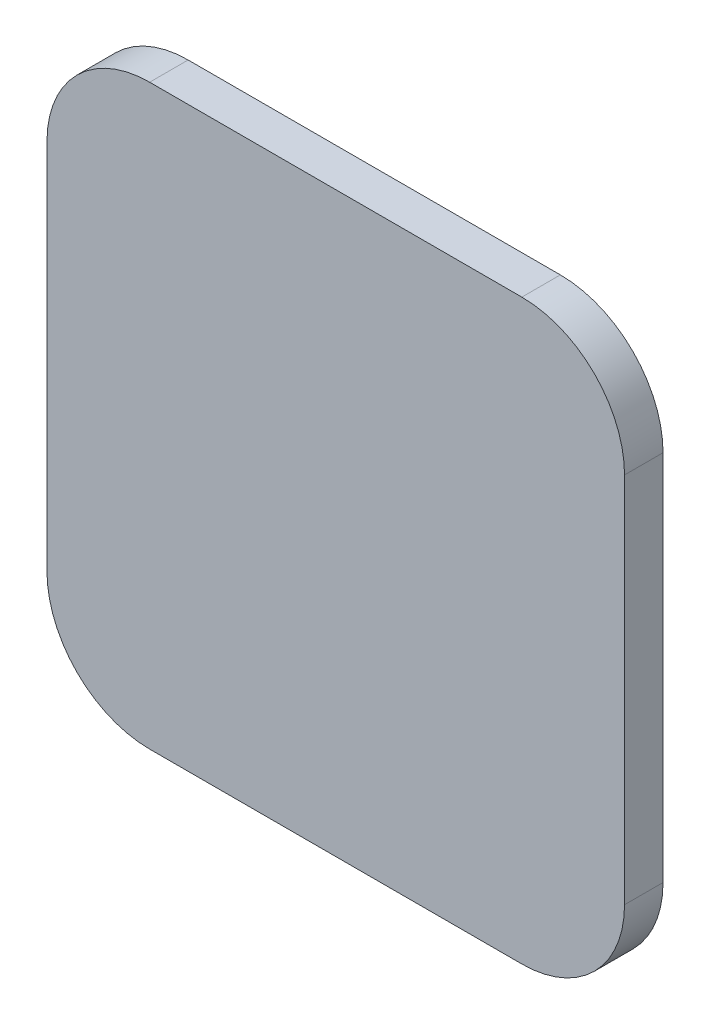
ISO-10303-21;
HEADER;
FILE_DESCRIPTION(('STEP AP214'),'2;1');
FILE_NAME('part.step','',(''),(''),'','','');
FILE_SCHEMA(('AUTOMOTIVE_DESIGN { 1 0 10303 214 1 1 1 1 }'));
ENDSEC;
DATA;
#1=APPLICATION_CONTEXT('core data for automotive mechanical design processes');
#2=APPLICATION_PROTOCOL_DEFINITION('international standard','automotive_design',2000,#1);
#3=PRODUCT_CONTEXT('',#1,'mechanical');
#4=PRODUCT('Part','Part','',(#3));
#5=PRODUCT_RELATED_PRODUCT_CATEGORY('part','',(#4));
#6=PRODUCT_DEFINITION_FORMATION('','',#4);
#7=PRODUCT_DEFINITION_CONTEXT('part definition',#1,'design');
#8=PRODUCT_DEFINITION('design','',#6,#7);
#9=PRODUCT_DEFINITION_SHAPE('','',#8);
#10=(LENGTH_UNIT() NAMED_UNIT(*) SI_UNIT(.MILLI.,.METRE.));
#11=(NAMED_UNIT(*) PLANE_ANGLE_UNIT() SI_UNIT($,.RADIAN.));
#12=(NAMED_UNIT(*) SI_UNIT($,.STERADIAN.) SOLID_ANGLE_UNIT());
#13=UNCERTAINTY_MEASURE_WITH_UNIT(LENGTH_MEASURE(1.E-05),#10,'distance_accuracy_value','');
#14=(GEOMETRIC_REPRESENTATION_CONTEXT(3) GLOBAL_UNCERTAINTY_ASSIGNED_CONTEXT((#13)) GLOBAL_UNIT_ASSIGNED_CONTEXT((#10,
#11,#12)) REPRESENTATION_CONTEXT('',''));
#15=CARTESIAN_POINT('',(0.,0.,0.));
#16=DIRECTION('',(0.,0.,1.));
#17=DIRECTION('',(1.,0.,0.));
#18=AXIS2_PLACEMENT_3D('',#15,#16,#17);
#19=CARTESIAN_POINT('',(1213.5748213672,143.,-3.));
#20=DIRECTION('',(0.,0.,1.));
#21=DIRECTION('',(1.,0.,0.));
#22=AXIS2_PLACEMENT_3D('',#19,#20,#21);
#23=CYLINDRICAL_SURFACE('',#22,8.00000000000001);
#24=CARTESIAN_POINT('',(1213.5748213672,143.,0.));
#25=DIRECTION('',(0.,0.,1.));
#26=DIRECTION('',(1.,0.,0.));
#27=AXIS2_PLACEMENT_3D('',#24,#25,#26);
#28=CIRCLE('',#27,8.00000000000001);
#29=CARTESIAN_POINT('',(1205.5748213672,143.,0.));
#30=VERTEX_POINT('',#29);
#31=CARTESIAN_POINT('',(1213.5748213672,135.,0.));
#32=VERTEX_POINT('',#31);
#33=EDGE_CURVE('E132',#30,#32,#28,.T.);
#34=ORIENTED_EDGE('',*,*,#33,.F.);
#35=DIRECTION('',(0.,0.,1.));
#36=VECTOR('',#35,1.);
#37=CARTESIAN_POINT('',(1205.5748213672,143.,-3.));
#38=LINE('',#37,#36);
#39=CARTESIAN_POINT('',(1205.5748213672,143.,-3.));
#40=VERTEX_POINT('',#39);
#41=EDGE_CURVE('E11',#40,#30,#38,.T.);
#42=ORIENTED_EDGE('',*,*,#41,.F.);
#43=CARTESIAN_POINT('',(1213.5748213672,143.,-3.));
#44=DIRECTION('',(0.,0.,1.));
#45=DIRECTION('',(1.,0.,0.));
#46=AXIS2_PLACEMENT_3D('',#43,#44,#45);
#47=CIRCLE('',#46,8.00000000000001);
#48=CARTESIAN_POINT('',(1213.5748213672,135.,-3.));
#49=VERTEX_POINT('',#48);
#50=EDGE_CURVE('E152',#40,#49,#47,.T.);
#51=ORIENTED_EDGE('',*,*,#50,.T.);
#52=DIRECTION('',(0.,0.,1.));
#53=VECTOR('',#52,1.);
#54=CARTESIAN_POINT('',(1213.5748213672,135.,-3.));
#55=LINE('',#54,#53);
#56=EDGE_CURVE('E38',#49,#32,#55,.T.);
#57=ORIENTED_EDGE('',*,*,#56,.T.);
#58=EDGE_LOOP('',(#34,#42,#51,#57));
#59=FACE_BOUND('',#58,.T.);
#60=ADVANCED_FACE('F35',(#59),#23,.T.);
#61=CARTESIAN_POINT('',(1205.5748213672,172.,-3.));
#62=DIRECTION('',(-1.,0.,0.));
#63=DIRECTION('',(0.,0.,1.));
#64=AXIS2_PLACEMENT_3D('',#61,#62,#63);
#65=PLANE('',#64);
#66=DIRECTION('',(0.,-1.,0.));
#67=VECTOR('',#66,1.);
#68=CARTESIAN_POINT('',(1205.5748213672,172.,0.));
#69=LINE('',#68,#67);
#70=CARTESIAN_POINT('',(1205.5748213672,172.,0.));
#71=VERTEX_POINT('',#70);
#72=EDGE_CURVE('E150',#71,#30,#69,.T.);
#73=ORIENTED_EDGE('',*,*,#72,.F.);
#74=DIRECTION('',(0.,0.,1.));
#75=VECTOR('',#74,1.);
#76=CARTESIAN_POINT('',(1205.5748213672,172.,-3.));
#77=LINE('',#76,#75);
#78=CARTESIAN_POINT('',(1205.5748213672,172.,-3.));
#79=VERTEX_POINT('',#78);
#80=EDGE_CURVE('E44',#79,#71,#77,.T.);
#81=ORIENTED_EDGE('',*,*,#80,.F.);
#82=DIRECTION('',(0.,-1.,0.));
#83=VECTOR('',#82,1.);
#84=CARTESIAN_POINT('',(1205.5748213672,172.,-3.));
#85=LINE('',#84,#83);
#86=EDGE_CURVE('E122',#79,#40,#85,.T.);
#87=ORIENTED_EDGE('',*,*,#86,.T.);
#88=ORIENTED_EDGE('',*,*,#41,.T.);
#89=EDGE_LOOP('',(#73,#81,#87,#88));
#90=FACE_BOUND('',#89,.T.);
#91=ADVANCED_FACE('F164',(#90),#65,.T.);
#92=CARTESIAN_POINT('',(1213.5748213672,172.,-3.));
#93=DIRECTION('',(0.,0.,1.));
#94=DIRECTION('',(1.,0.,0.));
#95=AXIS2_PLACEMENT_3D('',#92,#93,#94);
#96=CYLINDRICAL_SURFACE('',#95,8.00000000000001);
#97=CARTESIAN_POINT('',(1213.5748213672,172.,0.));
#98=DIRECTION('',(0.,0.,1.));
#99=DIRECTION('',(1.,0.,0.));
#100=AXIS2_PLACEMENT_3D('',#97,#98,#99);
#101=CIRCLE('',#100,8.00000000000001);
#102=CARTESIAN_POINT('',(1213.5748213672,180.,0.));
#103=VERTEX_POINT('',#102);
#104=EDGE_CURVE('E109',#103,#71,#101,.T.);
#105=ORIENTED_EDGE('',*,*,#104,.F.);
#106=DIRECTION('',(0.,0.,1.));
#107=VECTOR('',#106,1.);
#108=CARTESIAN_POINT('',(1213.5748213672,180.,-3.));
#109=LINE('',#108,#107);
#110=CARTESIAN_POINT('',(1213.5748213672,180.,-3.));
#111=VERTEX_POINT('',#110);
#112=EDGE_CURVE('E104',#111,#103,#109,.T.);
#113=ORIENTED_EDGE('',*,*,#112,.F.);
#114=CARTESIAN_POINT('',(1213.5748213672,172.,-3.));
#115=DIRECTION('',(0.,0.,1.));
#116=DIRECTION('',(1.,0.,0.));
#117=AXIS2_PLACEMENT_3D('',#114,#115,#116);
#118=CIRCLE('',#117,8.00000000000001);
#119=EDGE_CURVE('E107',#111,#79,#118,.T.);
#120=ORIENTED_EDGE('',*,*,#119,.T.);
#121=ORIENTED_EDGE('',*,*,#80,.T.);
#122=EDGE_LOOP('',(#105,#113,#120,#121));
#123=FACE_BOUND('',#122,.T.);
#124=ADVANCED_FACE('F106',(#123),#96,.T.);
#125=CARTESIAN_POINT('',(1242.5748213672,180.,-3.));
#126=DIRECTION('',(0.,1.,0.));
#127=DIRECTION('',(0.,0.,1.));
#128=AXIS2_PLACEMENT_3D('',#125,#126,#127);
#129=PLANE('',#128);
#130=DIRECTION('',(-1.,0.,0.));
#131=VECTOR('',#130,1.);
#132=CARTESIAN_POINT('',(1242.5748213672,180.,0.));
#133=LINE('',#132,#131);
#134=CARTESIAN_POINT('',(1242.5748213672,180.,0.));
#135=VERTEX_POINT('',#134);
#136=EDGE_CURVE('E147',#135,#103,#133,.T.);
#137=ORIENTED_EDGE('',*,*,#136,.F.);
#138=DIRECTION('',(0.,0.,1.));
#139=VECTOR('',#138,1.);
#140=CARTESIAN_POINT('',(1242.5748213672,180.,-3.));
#141=LINE('',#140,#139);
#142=CARTESIAN_POINT('',(1242.5748213672,180.,-3.));
#143=VERTEX_POINT('',#142);
#144=EDGE_CURVE('E114',#143,#135,#141,.T.);
#145=ORIENTED_EDGE('',*,*,#144,.F.);
#146=DIRECTION('',(-1.,0.,0.));
#147=VECTOR('',#146,1.);
#148=CARTESIAN_POINT('',(1242.5748213672,180.,-3.));
#149=LINE('',#148,#147);
#150=EDGE_CURVE('E120',#143,#111,#149,.T.);
#151=ORIENTED_EDGE('',*,*,#150,.T.);
#152=ORIENTED_EDGE('',*,*,#112,.T.);
#153=EDGE_LOOP('',(#137,#145,#151,#152));
#154=FACE_BOUND('',#153,.T.);
#155=ADVANCED_FACE('F124',(#154),#129,.T.);
#156=CARTESIAN_POINT('',(1242.5748213672,172.,-3.));
#157=DIRECTION('',(0.,0.,1.));
#158=DIRECTION('',(1.,0.,0.));
#159=AXIS2_PLACEMENT_3D('',#156,#157,#158);
#160=CYLINDRICAL_SURFACE('',#159,8.00000000000001);
#161=CARTESIAN_POINT('',(1242.5748213672,172.,0.));
#162=DIRECTION('',(0.,0.,1.));
#163=DIRECTION('',(1.,0.,0.));
#164=AXIS2_PLACEMENT_3D('',#161,#162,#163);
#165=CIRCLE('',#164,8.00000000000001);
#166=CARTESIAN_POINT('',(1250.5748213672,172.,0.));
#167=VERTEX_POINT('',#166);
#168=EDGE_CURVE('E144',#167,#135,#165,.T.);
#169=ORIENTED_EDGE('',*,*,#168,.F.);
#170=DIRECTION('',(0.,0.,1.));
#171=VECTOR('',#170,1.);
#172=CARTESIAN_POINT('',(1250.5748213672,172.,-3.));
#173=LINE('',#172,#171);
#174=CARTESIAN_POINT('',(1250.5748213672,172.,-3.));
#175=VERTEX_POINT('',#174);
#176=EDGE_CURVE('E156',#175,#167,#173,.T.);
#177=ORIENTED_EDGE('',*,*,#176,.F.);
#178=CARTESIAN_POINT('',(1242.5748213672,172.,-3.));
#179=DIRECTION('',(0.,0.,1.));
#180=DIRECTION('',(1.,0.,0.));
#181=AXIS2_PLACEMENT_3D('',#178,#179,#180);
#182=CIRCLE('',#181,8.00000000000001);
#183=EDGE_CURVE('E125',#175,#143,#182,.T.);
#184=ORIENTED_EDGE('',*,*,#183,.T.);
#185=ORIENTED_EDGE('',*,*,#144,.T.);
#186=EDGE_LOOP('',(#169,#177,#184,#185));
#187=FACE_BOUND('',#186,.T.);
#188=ADVANCED_FACE('F177',(#187),#160,.T.);
#189=CARTESIAN_POINT('',(1250.5748213672,143.,-3.));
#190=DIRECTION('',(1.,0.,0.));
#191=DIRECTION('',(0.,0.,-1.));
#192=AXIS2_PLACEMENT_3D('',#189,#190,#191);
#193=PLANE('',#192);
#194=DIRECTION('',(0.,1.,0.));
#195=VECTOR('',#194,1.);
#196=CARTESIAN_POINT('',(1250.5748213672,143.,0.));
#197=LINE('',#196,#195);
#198=CARTESIAN_POINT('',(1250.5748213672,143.,0.));
#199=VERTEX_POINT('',#198);
#200=EDGE_CURVE('E141',#199,#167,#197,.T.);
#201=ORIENTED_EDGE('',*,*,#200,.F.);
#202=DIRECTION('',(0.,0.,1.));
#203=VECTOR('',#202,1.);
#204=CARTESIAN_POINT('',(1250.5748213672,143.,-3.));
#205=LINE('',#204,#203);
#206=CARTESIAN_POINT('',(1250.5748213672,143.,-3.));
#207=VERTEX_POINT('',#206);
#208=EDGE_CURVE('E158',#207,#199,#205,.T.);
#209=ORIENTED_EDGE('',*,*,#208,.F.);
#210=DIRECTION('',(0.,1.,0.));
#211=VECTOR('',#210,1.);
#212=CARTESIAN_POINT('',(1250.5748213672,143.,-3.));
#213=LINE('',#212,#211);
#214=EDGE_CURVE('E127',#207,#175,#213,.T.);
#215=ORIENTED_EDGE('',*,*,#214,.T.);
#216=ORIENTED_EDGE('',*,*,#176,.T.);
#217=EDGE_LOOP('',(#201,#209,#215,#216));
#218=FACE_BOUND('',#217,.T.);
#219=ADVANCED_FACE('F180',(#218),#193,.T.);
#220=CARTESIAN_POINT('',(1242.5748213672,143.,-3.));
#221=DIRECTION('',(0.,0.,1.));
#222=DIRECTION('',(1.,0.,0.));
#223=AXIS2_PLACEMENT_3D('',#220,#221,#222);
#224=CYLINDRICAL_SURFACE('',#223,8.00000000000001);
#225=CARTESIAN_POINT('',(1242.5748213672,143.,0.));
#226=DIRECTION('',(0.,0.,1.));
#227=DIRECTION('',(1.,0.,0.));
#228=AXIS2_PLACEMENT_3D('',#225,#226,#227);
#229=CIRCLE('',#228,8.00000000000001);
#230=CARTESIAN_POINT('',(1242.5748213672,135.,0.));
#231=VERTEX_POINT('',#230);
#232=EDGE_CURVE('E138',#231,#199,#229,.T.);
#233=ORIENTED_EDGE('',*,*,#232,.F.);
#234=DIRECTION('',(0.,0.,1.));
#235=VECTOR('',#234,1.);
#236=CARTESIAN_POINT('',(1242.5748213672,135.,-3.));
#237=LINE('',#236,#235);
#238=CARTESIAN_POINT('',(1242.5748213672,135.,-3.));
#239=VERTEX_POINT('',#238);
#240=EDGE_CURVE('E159',#239,#231,#237,.T.);
#241=ORIENTED_EDGE('',*,*,#240,.F.);
#242=CARTESIAN_POINT('',(1242.5748213672,143.,-3.));
#243=DIRECTION('',(0.,0.,1.));
#244=DIRECTION('',(1.,0.,0.));
#245=AXIS2_PLACEMENT_3D('',#242,#243,#244);
#246=CIRCLE('',#245,8.00000000000001);
#247=EDGE_CURVE('E255',#239,#207,#246,.T.);
#248=ORIENTED_EDGE('',*,*,#247,.T.);
#249=ORIENTED_EDGE('',*,*,#208,.T.);
#250=EDGE_LOOP('',(#233,#241,#248,#249));
#251=FACE_BOUND('',#250,.T.);
#252=ADVANCED_FACE('F184',(#251),#224,.T.);
#253=CARTESIAN_POINT('',(1213.5748213672,135.,-3.));
#254=DIRECTION('',(0.,-1.,0.));
#255=DIRECTION('',(0.,0.,-1.));
#256=AXIS2_PLACEMENT_3D('',#253,#254,#255);
#257=PLANE('',#256);
#258=DIRECTION('',(1.,0.,0.));
#259=VECTOR('',#258,1.);
#260=CARTESIAN_POINT('',(1213.5748213672,135.,0.));
#261=LINE('',#260,#259);
#262=EDGE_CURVE('E135',#32,#231,#261,.T.);
#263=ORIENTED_EDGE('',*,*,#262,.F.);
#264=ORIENTED_EDGE('',*,*,#56,.F.);
#265=DIRECTION('',(1.,0.,0.));
#266=VECTOR('',#265,1.);
#267=CARTESIAN_POINT('',(1213.5748213672,135.,-3.));
#268=LINE('',#267,#266);
#269=EDGE_CURVE('E256',#49,#239,#268,.T.);
#270=ORIENTED_EDGE('',*,*,#269,.T.);
#271=ORIENTED_EDGE('',*,*,#240,.T.);
#272=EDGE_LOOP('',(#263,#264,#270,#271));
#273=FACE_BOUND('',#272,.T.);
#274=ADVANCED_FACE('F161',(#273),#257,.T.);
#275=CARTESIAN_POINT('',(1213.5748213672,143.,-3.));
#276=DIRECTION('',(0.,0.,1.));
#277=DIRECTION('',(1.,0.,0.));
#278=AXIS2_PLACEMENT_3D('',#275,#276,#277);
#279=PLANE('',#278);
#280=ORIENTED_EDGE('',*,*,#50,.F.);
#281=ORIENTED_EDGE('',*,*,#86,.F.);
#282=ORIENTED_EDGE('',*,*,#119,.F.);
#283=ORIENTED_EDGE('',*,*,#150,.F.);
#284=ORIENTED_EDGE('',*,*,#183,.F.);
#285=ORIENTED_EDGE('',*,*,#214,.F.);
#286=ORIENTED_EDGE('',*,*,#247,.F.);
#287=ORIENTED_EDGE('',*,*,#269,.F.);
#288=EDGE_LOOP('',(#280,#281,#282,#283,#284,#285,#286,#287));
#289=FACE_BOUND('',#288,.T.);
#290=ADVANCED_FACE('F118',(#289),#279,.F.);
#291=CARTESIAN_POINT('',(1213.5748213672,143.,0.));
#292=DIRECTION('',(0.,0.,1.));
#293=DIRECTION('',(1.,0.,0.));
#294=AXIS2_PLACEMENT_3D('',#291,#292,#293);
#295=PLANE('',#294);
#296=ORIENTED_EDGE('',*,*,#33,.T.);
#297=ORIENTED_EDGE('',*,*,#262,.T.);
#298=ORIENTED_EDGE('',*,*,#232,.T.);
#299=ORIENTED_EDGE('',*,*,#200,.T.);
#300=ORIENTED_EDGE('',*,*,#168,.T.);
#301=ORIENTED_EDGE('',*,*,#136,.T.);
#302=ORIENTED_EDGE('',*,*,#104,.T.);
#303=ORIENTED_EDGE('',*,*,#72,.T.);
#304=EDGE_LOOP('',(#296,#297,#298,#299,#300,#301,#302,#303));
#305=FACE_BOUND('',#304,.T.);
#306=ADVANCED_FACE('F163',(#305),#295,.T.);
#307=CLOSED_SHELL('',(#60,#91,#124,#155,#188,#219,#252,#274,#290,#306));
#308=MANIFOLD_SOLID_BREP('B2',#307);
#309=ADVANCED_BREP_SHAPE_REPRESENTATION('',(#18,#308),#14);
#310=SHAPE_DEFINITION_REPRESENTATION(#9,#309);
ENDSEC;
END-ISO-10303-21;
